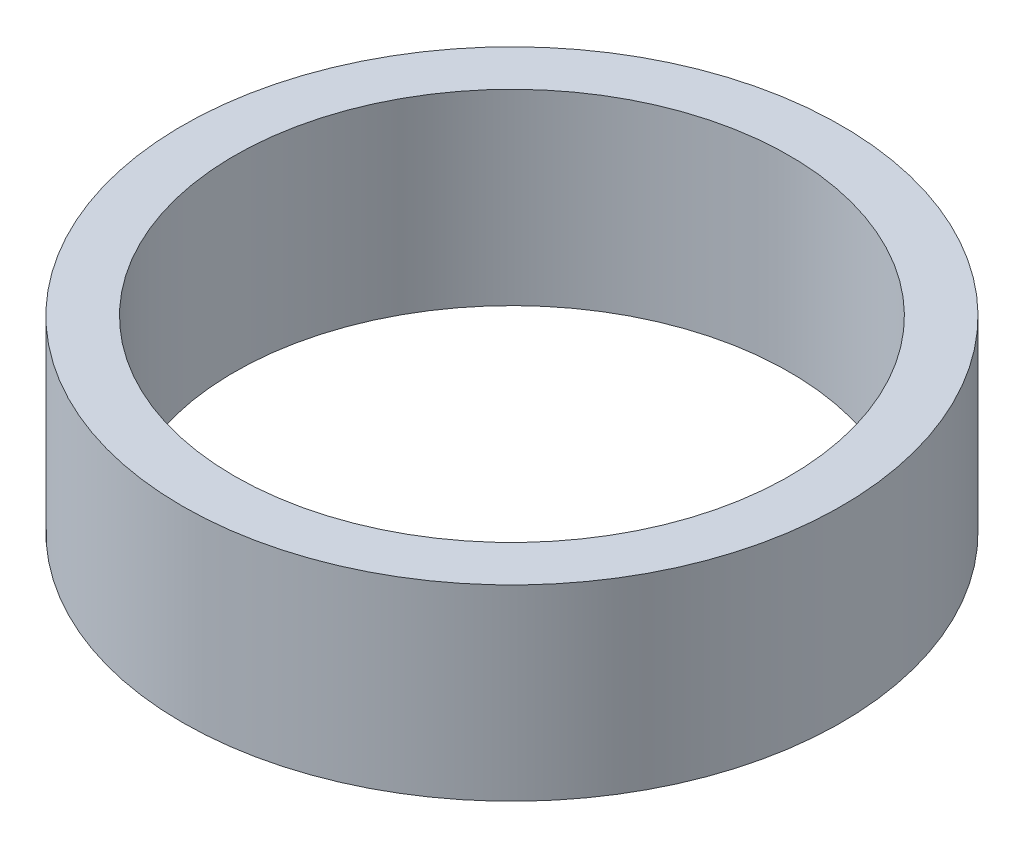
ISO-10303-21;
HEADER;
FILE_DESCRIPTION(('STEP AP214'),'2;1');
FILE_NAME('part.step','',(''),(''),'','','');
FILE_SCHEMA(('AUTOMOTIVE_DESIGN { 1 0 10303 214 1 1 1 1 }'));
ENDSEC;
DATA;
#1=APPLICATION_CONTEXT('core data for automotive mechanical design processes');
#2=APPLICATION_PROTOCOL_DEFINITION('international standard','automotive_design',2000,#1);
#3=PRODUCT_CONTEXT('',#1,'mechanical');
#4=PRODUCT('Part','Part','',(#3));
#5=PRODUCT_RELATED_PRODUCT_CATEGORY('part','',(#4));
#6=PRODUCT_DEFINITION_FORMATION('','',#4);
#7=PRODUCT_DEFINITION_CONTEXT('part definition',#1,'design');
#8=PRODUCT_DEFINITION('design','',#6,#7);
#9=PRODUCT_DEFINITION_SHAPE('','',#8);
#10=(LENGTH_UNIT() NAMED_UNIT(*) SI_UNIT(.MILLI.,.METRE.));
#11=(NAMED_UNIT(*) PLANE_ANGLE_UNIT() SI_UNIT($,.RADIAN.));
#12=(NAMED_UNIT(*) SI_UNIT($,.STERADIAN.) SOLID_ANGLE_UNIT());
#13=UNCERTAINTY_MEASURE_WITH_UNIT(LENGTH_MEASURE(1.E-05),#10,'distance_accuracy_value','');
#14=(GEOMETRIC_REPRESENTATION_CONTEXT(3) GLOBAL_UNCERTAINTY_ASSIGNED_CONTEXT((#13)) GLOBAL_UNIT_ASSIGNED_CONTEXT((#10,
#11,#12)) REPRESENTATION_CONTEXT('',''));
#15=CARTESIAN_POINT('',(0.,0.,0.));
#16=DIRECTION('',(0.,0.,1.));
#17=DIRECTION('',(1.,0.,0.));
#18=AXIS2_PLACEMENT_3D('',#15,#16,#17);
#19=CARTESIAN_POINT('',(0.,27.,0.));
#20=DIRECTION('',(0.,-1.,0.));
#21=DIRECTION('',(0.,0.,-1.));
#22=AXIS2_PLACEMENT_3D('',#19,#20,#21);
#23=CYLINDRICAL_SURFACE('',#22,47.5);
#24=CARTESIAN_POINT('',(0.,27.,0.));
#25=DIRECTION('',(0.,1.,0.));
#26=DIRECTION('',(0.,0.,1.));
#27=AXIS2_PLACEMENT_3D('',#24,#25,#26);
#28=CIRCLE('',#27,47.5);
#29=CARTESIAN_POINT('',(0.,27.,47.5));
#30=VERTEX_POINT('',#29);
#31=EDGE_CURVE('E10',#30,#30,#28,.T.);
#32=ORIENTED_EDGE('',*,*,#31,.F.);
#33=EDGE_LOOP('',(#32));
#34=FACE_BOUND('',#33,.T.);
#35=CARTESIAN_POINT('',(0.,0.,0.));
#36=DIRECTION('',(0.,1.,0.));
#37=DIRECTION('',(0.,0.,1.));
#38=AXIS2_PLACEMENT_3D('',#35,#36,#37);
#39=CIRCLE('',#38,47.5);
#40=CARTESIAN_POINT('',(0.,0.,47.5));
#41=VERTEX_POINT('',#40);
#42=EDGE_CURVE('E37',#41,#41,#39,.T.);
#43=ORIENTED_EDGE('',*,*,#42,.T.);
#44=EDGE_LOOP('',(#43));
#45=FACE_BOUND('',#44,.T.);
#46=ADVANCED_FACE('F40',(#34,#45),#23,.T.);
#47=CARTESIAN_POINT('',(0.,27.,0.));
#48=DIRECTION('',(0.,1.,0.));
#49=DIRECTION('',(0.,0.,1.));
#50=AXIS2_PLACEMENT_3D('',#47,#48,#49);
#51=PLANE('',#50);
#52=CARTESIAN_POINT('',(0.,27.,0.));
#53=DIRECTION('',(0.,1.,0.));
#54=DIRECTION('',(0.,0.,1.));
#55=AXIS2_PLACEMENT_3D('',#52,#53,#54);
#56=CIRCLE('',#55,40.);
#57=CARTESIAN_POINT('',(0.,27.,40.));
#58=VERTEX_POINT('',#57);
#59=EDGE_CURVE('E50',#58,#58,#56,.T.);
#60=ORIENTED_EDGE('',*,*,#59,.F.);
#61=EDGE_LOOP('',(#60));
#62=FACE_BOUND('',#61,.T.);
#63=ORIENTED_EDGE('',*,*,#31,.T.);
#64=EDGE_LOOP('',(#63));
#65=FACE_BOUND('',#64,.T.);
#66=ADVANCED_FACE('F59',(#62,#65),#51,.T.);
#67=CARTESIAN_POINT('',(0.,0.,0.));
#68=DIRECTION('',(0.,1.,0.));
#69=DIRECTION('',(0.,0.,1.));
#70=AXIS2_PLACEMENT_3D('',#67,#68,#69);
#71=PLANE('',#70);
#72=CARTESIAN_POINT('',(0.,0.,0.));
#73=DIRECTION('',(0.,1.,0.));
#74=DIRECTION('',(0.,0.,1.));
#75=AXIS2_PLACEMENT_3D('',#72,#73,#74);
#76=CIRCLE('',#75,40.);
#77=CARTESIAN_POINT('',(0.,0.,40.));
#78=VERTEX_POINT('',#77);
#79=EDGE_CURVE('E47',#78,#78,#76,.T.);
#80=ORIENTED_EDGE('',*,*,#79,.T.);
#81=EDGE_LOOP('',(#80));
#82=FACE_BOUND('',#81,.T.);
#83=ORIENTED_EDGE('',*,*,#42,.F.);
#84=EDGE_LOOP('',(#83));
#85=FACE_BOUND('',#84,.T.);
#86=ADVANCED_FACE('F58',(#82,#85),#71,.F.);
#87=CARTESIAN_POINT('',(0.,27.,0.));
#88=DIRECTION('',(0.,-1.,0.));
#89=DIRECTION('',(0.,0.,-1.));
#90=AXIS2_PLACEMENT_3D('',#87,#88,#89);
#91=CYLINDRICAL_SURFACE('',#90,40.);
#92=ORIENTED_EDGE('',*,*,#59,.T.);
#93=EDGE_LOOP('',(#92));
#94=FACE_BOUND('',#93,.T.);
#95=ORIENTED_EDGE('',*,*,#79,.F.);
#96=EDGE_LOOP('',(#95));
#97=FACE_BOUND('',#96,.T.);
#98=ADVANCED_FACE('F54',(#94,#97),#91,.F.);
#99=CLOSED_SHELL('',(#46,#66,#86,#98));
#100=MANIFOLD_SOLID_BREP('B2',#99);
#101=ADVANCED_BREP_SHAPE_REPRESENTATION('',(#18,#100),#14);
#102=SHAPE_DEFINITION_REPRESENTATION(#9,#101);
ENDSEC;
END-ISO-10303-21;
